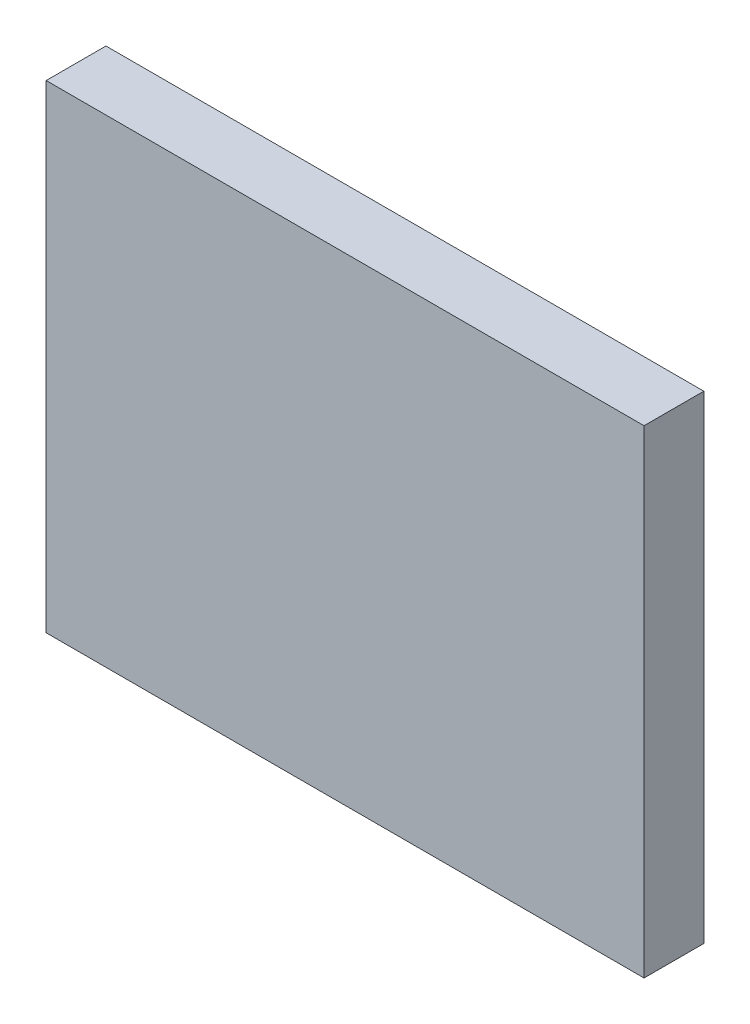
ISO-10303-21;
HEADER;
FILE_DESCRIPTION(('STEP AP214'),'2;1');
FILE_NAME('part.step','',(''),(''),'','','');
FILE_SCHEMA(('AUTOMOTIVE_DESIGN { 1 0 10303 214 1 1 1 1 }'));
ENDSEC;
DATA;
#1=APPLICATION_CONTEXT('core data for automotive mechanical design processes');
#2=APPLICATION_PROTOCOL_DEFINITION('international standard','automotive_design',2000,#1);
#3=PRODUCT_CONTEXT('',#1,'mechanical');
#4=PRODUCT('Part','Part','',(#3));
#5=PRODUCT_RELATED_PRODUCT_CATEGORY('part','',(#4));
#6=PRODUCT_DEFINITION_FORMATION('','',#4);
#7=PRODUCT_DEFINITION_CONTEXT('part definition',#1,'design');
#8=PRODUCT_DEFINITION('design','',#6,#7);
#9=PRODUCT_DEFINITION_SHAPE('','',#8);
#10=(LENGTH_UNIT() NAMED_UNIT(*) SI_UNIT(.MILLI.,.METRE.));
#11=(NAMED_UNIT(*) PLANE_ANGLE_UNIT() SI_UNIT($,.RADIAN.));
#12=(NAMED_UNIT(*) SI_UNIT($,.STERADIAN.) SOLID_ANGLE_UNIT());
#13=UNCERTAINTY_MEASURE_WITH_UNIT(LENGTH_MEASURE(1.E-05),#10,'distance_accuracy_value','');
#14=(GEOMETRIC_REPRESENTATION_CONTEXT(3) GLOBAL_UNCERTAINTY_ASSIGNED_CONTEXT((#13)) GLOBAL_UNIT_ASSIGNED_CONTEXT((#10,
#11,#12)) REPRESENTATION_CONTEXT('',''));
#15=CARTESIAN_POINT('',(0.,0.,0.));
#16=DIRECTION('',(0.,0.,1.));
#17=DIRECTION('',(1.,0.,0.));
#18=AXIS2_PLACEMENT_3D('',#15,#16,#17);
#19=CARTESIAN_POINT('',(-20.5882352941177,9.20716112531969,5.));
#20=DIRECTION('',(1.,0.,0.));
#21=DIRECTION('',(0.,0.,-1.));
#22=AXIS2_PLACEMENT_3D('',#19,#20,#21);
#23=PLANE('',#22);
#24=DIRECTION('',(0.,-1.,0.));
#25=VECTOR('',#24,1.);
#26=CARTESIAN_POINT('',(-20.5882352941177,9.20716112531969,0.));
#27=LINE('',#26,#25);
#28=CARTESIAN_POINT('',(-20.5882352941177,9.20716112531969,0.));
#29=VERTEX_POINT('',#28);
#30=CARTESIAN_POINT('',(-20.5882352941177,-30.7928388746803,0.));
#31=VERTEX_POINT('',#30);
#32=EDGE_CURVE('E96',#29,#31,#27,.T.);
#33=ORIENTED_EDGE('',*,*,#32,.T.);
#34=DIRECTION('',(0.,0.,-1.));
#35=VECTOR('',#34,1.);
#36=CARTESIAN_POINT('',(-20.5882352941177,-30.7928388746803,5.));
#37=LINE('',#36,#35);
#38=CARTESIAN_POINT('',(-20.5882352941177,-30.7928388746803,5.));
#39=VERTEX_POINT('',#38);
#40=EDGE_CURVE('E11',#39,#31,#37,.T.);
#41=ORIENTED_EDGE('',*,*,#40,.F.);
#42=DIRECTION('',(0.,-1.,0.));
#43=VECTOR('',#42,1.);
#44=CARTESIAN_POINT('',(-20.5882352941177,9.20716112531969,5.));
#45=LINE('',#44,#43);
#46=CARTESIAN_POINT('',(-20.5882352941177,9.20716112531969,5.));
#47=VERTEX_POINT('',#46);
#48=EDGE_CURVE('E84',#47,#39,#45,.T.);
#49=ORIENTED_EDGE('',*,*,#48,.F.);
#50=DIRECTION('',(0.,0.,-1.));
#51=VECTOR('',#50,1.);
#52=CARTESIAN_POINT('',(-20.5882352941177,9.20716112531969,5.));
#53=LINE('',#52,#51);
#54=EDGE_CURVE('E92',#47,#29,#53,.T.);
#55=ORIENTED_EDGE('',*,*,#54,.T.);
#56=EDGE_LOOP('',(#33,#41,#49,#55));
#57=FACE_BOUND('',#56,.T.);
#58=ADVANCED_FACE('F33',(#57),#23,.F.);
#59=CARTESIAN_POINT('',(-20.5882352941177,-30.7928388746803,5.));
#60=DIRECTION('',(0.,1.,0.));
#61=DIRECTION('',(0.,0.,1.));
#62=AXIS2_PLACEMENT_3D('',#59,#60,#61);
#63=PLANE('',#62);
#64=DIRECTION('',(1.,0.,0.));
#65=VECTOR('',#64,1.);
#66=CARTESIAN_POINT('',(-20.5882352941177,-30.7928388746803,0.));
#67=LINE('',#66,#65);
#68=CARTESIAN_POINT('',(29.4117647058824,-30.7928388746803,0.));
#69=VERTEX_POINT('',#68);
#70=EDGE_CURVE('E88',#31,#69,#67,.T.);
#71=ORIENTED_EDGE('',*,*,#70,.T.);
#72=DIRECTION('',(0.,0.,-1.));
#73=VECTOR('',#72,1.);
#74=CARTESIAN_POINT('',(29.4117647058824,-30.7928388746803,5.));
#75=LINE('',#74,#73);
#76=CARTESIAN_POINT('',(29.4117647058824,-30.7928388746803,5.));
#77=VERTEX_POINT('',#76);
#78=EDGE_CURVE('E41',#77,#69,#75,.T.);
#79=ORIENTED_EDGE('',*,*,#78,.F.);
#80=DIRECTION('',(1.,0.,0.));
#81=VECTOR('',#80,1.);
#82=CARTESIAN_POINT('',(-20.5882352941177,-30.7928388746803,5.));
#83=LINE('',#82,#81);
#84=EDGE_CURVE('E79',#39,#77,#83,.T.);
#85=ORIENTED_EDGE('',*,*,#84,.F.);
#86=ORIENTED_EDGE('',*,*,#40,.T.);
#87=EDGE_LOOP('',(#71,#79,#85,#86));
#88=FACE_BOUND('',#87,.T.);
#89=ADVANCED_FACE('F87',(#88),#63,.F.);
#90=CARTESIAN_POINT('',(29.4117647058823,9.20716112531969,5.));
#91=DIRECTION('',(-1.,0.,0.));
#92=DIRECTION('',(0.,-1.,0.));
#93=AXIS2_PLACEMENT_3D('',#90,#91,#92);
#94=PLANE('',#93);
#95=DIRECTION('',(0.,1.,0.));
#96=VECTOR('',#95,1.);
#97=CARTESIAN_POINT('',(29.4117647058823,9.20716112531969,0.));
#98=LINE('',#97,#96);
#99=CARTESIAN_POINT('',(29.4117647058823,9.20716112531969,0.));
#100=VERTEX_POINT('',#99);
#101=EDGE_CURVE('E66',#69,#100,#98,.T.);
#102=ORIENTED_EDGE('',*,*,#101,.T.);
#103=DIRECTION('',(0.,0.,-1.));
#104=VECTOR('',#103,1.);
#105=CARTESIAN_POINT('',(29.4117647058823,9.20716112531969,5.));
#106=LINE('',#105,#104);
#107=CARTESIAN_POINT('',(29.4117647058823,9.20716112531969,5.));
#108=VERTEX_POINT('',#107);
#109=EDGE_CURVE('E89',#108,#100,#106,.T.);
#110=ORIENTED_EDGE('',*,*,#109,.F.);
#111=DIRECTION('',(0.,1.,0.));
#112=VECTOR('',#111,1.);
#113=CARTESIAN_POINT('',(29.4117647058823,9.20716112531969,5.));
#114=LINE('',#113,#112);
#115=EDGE_CURVE('E82',#77,#108,#114,.T.);
#116=ORIENTED_EDGE('',*,*,#115,.F.);
#117=ORIENTED_EDGE('',*,*,#78,.T.);
#118=EDGE_LOOP('',(#102,#110,#116,#117));
#119=FACE_BOUND('',#118,.T.);
#120=ADVANCED_FACE('F90',(#119),#94,.F.);
#121=CARTESIAN_POINT('',(-20.5882352941177,9.20716112531969,5.));
#122=DIRECTION('',(0.,-1.,0.));
#123=DIRECTION('',(0.,0.,-1.));
#124=AXIS2_PLACEMENT_3D('',#121,#122,#123);
#125=PLANE('',#124);
#126=DIRECTION('',(-1.,0.,0.));
#127=VECTOR('',#126,1.);
#128=CARTESIAN_POINT('',(-20.5882352941177,9.20716112531969,0.));
#129=LINE('',#128,#127);
#130=EDGE_CURVE('E72',#100,#29,#129,.T.);
#131=ORIENTED_EDGE('',*,*,#130,.T.);
#132=ORIENTED_EDGE('',*,*,#54,.F.);
#133=DIRECTION('',(-1.,0.,0.));
#134=VECTOR('',#133,1.);
#135=CARTESIAN_POINT('',(-20.5882352941177,9.20716112531969,5.));
#136=LINE('',#135,#134);
#137=EDGE_CURVE('E49',#108,#47,#136,.T.);
#138=ORIENTED_EDGE('',*,*,#137,.F.);
#139=ORIENTED_EDGE('',*,*,#109,.T.);
#140=EDGE_LOOP('',(#131,#132,#138,#139));
#141=FACE_BOUND('',#140,.T.);
#142=ADVANCED_FACE('F103',(#141),#125,.F.);
#143=CARTESIAN_POINT('',(0.,0.,5.));
#144=DIRECTION('',(0.,0.,1.));
#145=DIRECTION('',(1.,0.,0.));
#146=AXIS2_PLACEMENT_3D('',#143,#144,#145);
#147=PLANE('',#146);
#148=ORIENTED_EDGE('',*,*,#48,.T.);
#149=ORIENTED_EDGE('',*,*,#84,.T.);
#150=ORIENTED_EDGE('',*,*,#115,.T.);
#151=ORIENTED_EDGE('',*,*,#137,.T.);
#152=EDGE_LOOP('',(#148,#149,#150,#151));
#153=FACE_BOUND('',#152,.T.);
#154=ADVANCED_FACE('F80',(#153),#147,.T.);
#155=CARTESIAN_POINT('',(0.,0.,0.));
#156=DIRECTION('',(0.,0.,1.));
#157=DIRECTION('',(1.,0.,0.));
#158=AXIS2_PLACEMENT_3D('',#155,#156,#157);
#159=PLANE('',#158);
#160=ORIENTED_EDGE('',*,*,#32,.F.);
#161=ORIENTED_EDGE('',*,*,#130,.F.);
#162=ORIENTED_EDGE('',*,*,#101,.F.);
#163=ORIENTED_EDGE('',*,*,#70,.F.);
#164=EDGE_LOOP('',(#160,#161,#162,#163));
#165=FACE_BOUND('',#164,.T.);
#166=ADVANCED_FACE('F106',(#165),#159,.F.);
#167=CLOSED_SHELL('',(#58,#89,#120,#142,#154,#166));
#168=MANIFOLD_SOLID_BREP('B2',#167);
#169=ADVANCED_BREP_SHAPE_REPRESENTATION('',(#18,#168),#14);
#170=SHAPE_DEFINITION_REPRESENTATION(#9,#169);
ENDSEC;
END-ISO-10303-21;
